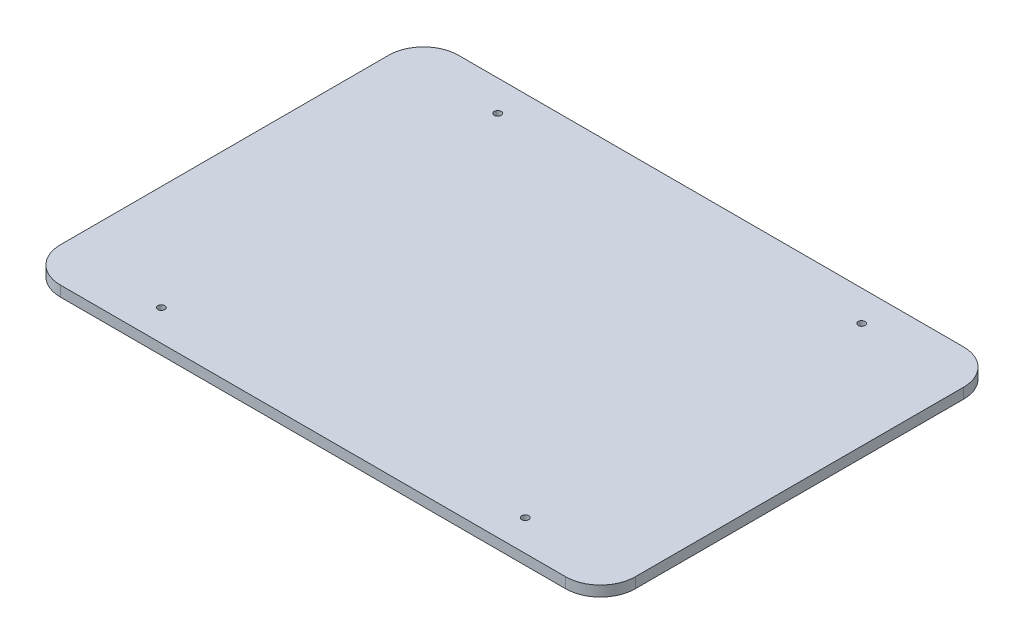
ISO-10303-21;
HEADER;
FILE_DESCRIPTION(('STEP AP214'),'2;1');
FILE_NAME('part.step','',(''),(''),'','','');
FILE_SCHEMA(('AUTOMOTIVE_DESIGN { 1 0 10303 214 1 1 1 1 }'));
ENDSEC;
DATA;
#1=APPLICATION_CONTEXT('core data for automotive mechanical design processes');
#2=APPLICATION_PROTOCOL_DEFINITION('international standard','automotive_design',2000,#1);
#3=PRODUCT_CONTEXT('',#1,'mechanical');
#4=PRODUCT('Part','Part','',(#3));
#5=PRODUCT_RELATED_PRODUCT_CATEGORY('part','',(#4));
#6=PRODUCT_DEFINITION_FORMATION('','',#4);
#7=PRODUCT_DEFINITION_CONTEXT('part definition',#1,'design');
#8=PRODUCT_DEFINITION('design','',#6,#7);
#9=PRODUCT_DEFINITION_SHAPE('','',#8);
#10=(LENGTH_UNIT() NAMED_UNIT(*) SI_UNIT(.MILLI.,.METRE.));
#11=(NAMED_UNIT(*) PLANE_ANGLE_UNIT() SI_UNIT($,.RADIAN.));
#12=(NAMED_UNIT(*) SI_UNIT($,.STERADIAN.) SOLID_ANGLE_UNIT());
#13=UNCERTAINTY_MEASURE_WITH_UNIT(LENGTH_MEASURE(1.E-05),#10,'distance_accuracy_value','');
#14=(GEOMETRIC_REPRESENTATION_CONTEXT(3) GLOBAL_UNCERTAINTY_ASSIGNED_CONTEXT((#13)) GLOBAL_UNIT_ASSIGNED_CONTEXT((#10,
#11,#12)) REPRESENTATION_CONTEXT('',''));
#15=CARTESIAN_POINT('',(0.,0.,0.));
#16=DIRECTION('',(0.,0.,1.));
#17=DIRECTION('',(1.,0.,0.));
#18=AXIS2_PLACEMENT_3D('',#15,#16,#17);
#19=CARTESIAN_POINT('',(82.55,3.,-57.15));
#20=DIRECTION('',(-1.,0.,0.));
#21=DIRECTION('',(0.,0.,1.));
#22=AXIS2_PLACEMENT_3D('',#19,#20,#21);
#23=PLANE('',#22);
#24=DIRECTION('',(0.,0.,-1.));
#25=VECTOR('',#24,1.);
#26=CARTESIAN_POINT('',(82.55,3.,-57.15));
#27=LINE('',#26,#25);
#28=CARTESIAN_POINT('',(82.55,3.,47.15));
#29=VERTEX_POINT('',#28);
#30=CARTESIAN_POINT('',(82.55,3.,-47.15));
#31=VERTEX_POINT('',#30);
#32=EDGE_CURVE('E118',#29,#31,#27,.T.);
#33=ORIENTED_EDGE('',*,*,#32,.F.);
#34=DIRECTION('',(0.,-1.,0.));
#35=VECTOR('',#34,1.);
#36=CARTESIAN_POINT('',(82.55,3.,47.15));
#37=LINE('',#36,#35);
#38=CARTESIAN_POINT('',(82.55,0.,47.15));
#39=VERTEX_POINT('',#38);
#40=EDGE_CURVE('E103',#29,#39,#37,.T.);
#41=ORIENTED_EDGE('',*,*,#40,.T.);
#42=DIRECTION('',(0.,0.,-1.));
#43=VECTOR('',#42,1.);
#44=CARTESIAN_POINT('',(82.55,0.,-57.15));
#45=LINE('',#44,#43);
#46=CARTESIAN_POINT('',(82.55,0.,-47.15));
#47=VERTEX_POINT('',#46);
#48=EDGE_CURVE('E115',#39,#47,#45,.T.);
#49=ORIENTED_EDGE('',*,*,#48,.T.);
#50=DIRECTION('',(0.,-1.,0.));
#51=VECTOR('',#50,1.);
#52=CARTESIAN_POINT('',(82.55,3.,-47.15));
#53=LINE('',#52,#51);
#54=EDGE_CURVE('E120',#47,#31,#53,.F.);
#55=ORIENTED_EDGE('',*,*,#54,.T.);
#56=EDGE_LOOP('',(#33,#41,#49,#55));
#57=FACE_BOUND('',#56,.T.);
#58=ADVANCED_FACE('F33',(#57),#23,.F.);
#59=CARTESIAN_POINT('',(-82.55,3.,-57.15));
#60=DIRECTION('',(0.,0.,1.));
#61=DIRECTION('',(1.,0.,0.));
#62=AXIS2_PLACEMENT_3D('',#59,#60,#61);
#63=PLANE('',#62);
#64=DIRECTION('',(-1.,0.,0.));
#65=VECTOR('',#64,1.);
#66=CARTESIAN_POINT('',(-82.55,3.,-57.15));
#67=LINE('',#66,#65);
#68=CARTESIAN_POINT('',(72.55,3.,-57.15));
#69=VERTEX_POINT('',#68);
#70=CARTESIAN_POINT('',(-72.55,3.,-57.15));
#71=VERTEX_POINT('',#70);
#72=EDGE_CURVE('E164',#69,#71,#67,.T.);
#73=ORIENTED_EDGE('',*,*,#72,.F.);
#74=DIRECTION('',(0.,-1.,0.));
#75=VECTOR('',#74,1.);
#76=CARTESIAN_POINT('',(72.55,3.,-57.15));
#77=LINE('',#76,#75);
#78=CARTESIAN_POINT('',(72.55,0.,-57.15));
#79=VERTEX_POINT('',#78);
#80=EDGE_CURVE('E157',#69,#79,#77,.T.);
#81=ORIENTED_EDGE('',*,*,#80,.T.);
#82=DIRECTION('',(-1.,0.,0.));
#83=VECTOR('',#82,1.);
#84=CARTESIAN_POINT('',(-82.55,0.,-57.15));
#85=LINE('',#84,#83);
#86=CARTESIAN_POINT('',(-72.55,0.,-57.15));
#87=VERTEX_POINT('',#86);
#88=EDGE_CURVE('E124',#79,#87,#85,.T.);
#89=ORIENTED_EDGE('',*,*,#88,.T.);
#90=DIRECTION('',(0.,-1.,0.));
#91=VECTOR('',#90,1.);
#92=CARTESIAN_POINT('',(-72.55,3.,-57.15));
#93=LINE('',#92,#91);
#94=EDGE_CURVE('E155',#87,#71,#93,.F.);
#95=ORIENTED_EDGE('',*,*,#94,.T.);
#96=EDGE_LOOP('',(#73,#81,#89,#95));
#97=FACE_BOUND('',#96,.T.);
#98=ADVANCED_FACE('F162',(#97),#63,.F.);
#99=CARTESIAN_POINT('',(-82.55,3.,-57.15));
#100=DIRECTION('',(1.,0.,0.));
#101=DIRECTION('',(0.,0.,-1.));
#102=AXIS2_PLACEMENT_3D('',#99,#100,#101);
#103=PLANE('',#102);
#104=DIRECTION('',(0.,0.,1.));
#105=VECTOR('',#104,1.);
#106=CARTESIAN_POINT('',(-82.55,3.,-57.15));
#107=LINE('',#106,#105);
#108=CARTESIAN_POINT('',(-82.55,3.,-47.15));
#109=VERTEX_POINT('',#108);
#110=CARTESIAN_POINT('',(-82.55,3.,47.15));
#111=VERTEX_POINT('',#110);
#112=EDGE_CURVE('E172',#109,#111,#107,.T.);
#113=ORIENTED_EDGE('',*,*,#112,.F.);
#114=DIRECTION('',(0.,-1.,0.));
#115=VECTOR('',#114,1.);
#116=CARTESIAN_POINT('',(-82.55,3.,-47.15));
#117=LINE('',#116,#115);
#118=CARTESIAN_POINT('',(-82.55,0.,-47.15));
#119=VERTEX_POINT('',#118);
#120=EDGE_CURVE('E11',#109,#119,#117,.T.);
#121=ORIENTED_EDGE('',*,*,#120,.T.);
#122=DIRECTION('',(0.,0.,1.));
#123=VECTOR('',#122,1.);
#124=CARTESIAN_POINT('',(-82.55,0.,-57.15));
#125=LINE('',#124,#123);
#126=CARTESIAN_POINT('',(-82.55,0.,47.15));
#127=VERTEX_POINT('',#126);
#128=EDGE_CURVE('E128',#119,#127,#125,.T.);
#129=ORIENTED_EDGE('',*,*,#128,.T.);
#130=DIRECTION('',(0.,-1.,0.));
#131=VECTOR('',#130,1.);
#132=CARTESIAN_POINT('',(-82.55,3.,47.15));
#133=LINE('',#132,#131);
#134=EDGE_CURVE('E41',#127,#111,#133,.F.);
#135=ORIENTED_EDGE('',*,*,#134,.T.);
#136=EDGE_LOOP('',(#113,#121,#129,#135));
#137=FACE_BOUND('',#136,.T.);
#138=ADVANCED_FACE('F171',(#137),#103,.F.);
#139=CARTESIAN_POINT('',(-82.55,3.,57.15));
#140=DIRECTION('',(0.,0.,-1.));
#141=DIRECTION('',(-1.,0.,0.));
#142=AXIS2_PLACEMENT_3D('',#139,#140,#141);
#143=PLANE('',#142);
#144=DIRECTION('',(1.,0.,0.));
#145=VECTOR('',#144,1.);
#146=CARTESIAN_POINT('',(-82.55,0.,57.15));
#147=LINE('',#146,#145);
#148=CARTESIAN_POINT('',(-72.55,0.,57.15));
#149=VERTEX_POINT('',#148);
#150=CARTESIAN_POINT('',(72.55,0.,57.15));
#151=VERTEX_POINT('',#150);
#152=EDGE_CURVE('E138',#149,#151,#147,.T.);
#153=ORIENTED_EDGE('',*,*,#152,.T.);
#154=DIRECTION('',(0.,-1.,0.));
#155=VECTOR('',#154,1.);
#156=CARTESIAN_POINT('',(72.55,3.,57.15));
#157=LINE('',#156,#155);
#158=CARTESIAN_POINT('',(72.55,3.,57.15));
#159=VERTEX_POINT('',#158);
#160=EDGE_CURVE('E104',#151,#159,#157,.F.);
#161=ORIENTED_EDGE('',*,*,#160,.T.);
#162=DIRECTION('',(1.,0.,0.));
#163=VECTOR('',#162,1.);
#164=CARTESIAN_POINT('',(-82.55,3.,57.15));
#165=LINE('',#164,#163);
#166=CARTESIAN_POINT('',(-72.55,3.,57.15));
#167=VERTEX_POINT('',#166);
#168=EDGE_CURVE('E134',#167,#159,#165,.T.);
#169=ORIENTED_EDGE('',*,*,#168,.F.);
#170=DIRECTION('',(0.,-1.,0.));
#171=VECTOR('',#170,1.);
#172=CARTESIAN_POINT('',(-72.55,3.,57.15));
#173=LINE('',#172,#171);
#174=EDGE_CURVE('E109',#167,#149,#173,.T.);
#175=ORIENTED_EDGE('',*,*,#174,.T.);
#176=EDGE_LOOP('',(#153,#161,#169,#175));
#177=FACE_BOUND('',#176,.T.);
#178=ADVANCED_FACE('F257',(#177),#143,.F.);
#179=CARTESIAN_POINT('',(0.,3.,0.));
#180=DIRECTION('',(0.,1.,0.));
#181=DIRECTION('',(0.,0.,1.));
#182=AXIS2_PLACEMENT_3D('',#179,#180,#181);
#183=PLANE('',#182);
#184=CARTESIAN_POINT('',(-52.4300000000003,3.,-48.3399999999993));
#185=DIRECTION('',(0.,-1.,0.));
#186=DIRECTION('',(0.,0.,-1.));
#187=AXIS2_PLACEMENT_3D('',#184,#185,#186);
#188=CIRCLE('',#187,0.999999999999998);
#189=CARTESIAN_POINT('',(-52.4300000000003,3.,-49.3399999999993));
#190=VERTEX_POINT('',#189);
#191=EDGE_CURVE('E179',#190,#190,#188,.T.);
#192=ORIENTED_EDGE('',*,*,#191,.T.);
#193=EDGE_LOOP('',(#192));
#194=FACE_BOUND('',#193,.T.);
#195=CARTESIAN_POINT('',(52.07,3.,48.26));
#196=DIRECTION('',(0.,-1.,0.));
#197=DIRECTION('',(0.,0.,-1.));
#198=AXIS2_PLACEMENT_3D('',#195,#196,#197);
#199=CIRCLE('',#198,0.999999999999998);
#200=CARTESIAN_POINT('',(52.07,3.,47.26));
#201=VERTEX_POINT('',#200);
#202=EDGE_CURVE('E184',#201,#201,#199,.T.);
#203=ORIENTED_EDGE('',*,*,#202,.T.);
#204=EDGE_LOOP('',(#203));
#205=FACE_BOUND('',#204,.T.);
#206=CARTESIAN_POINT('',(52.0699999999997,3.,-48.34));
#207=DIRECTION('',(0.,-1.,0.));
#208=DIRECTION('',(0.,0.,-1.));
#209=AXIS2_PLACEMENT_3D('',#206,#207,#208);
#210=CIRCLE('',#209,0.999999999999998);
#211=CARTESIAN_POINT('',(52.0699999999997,3.,-49.34));
#212=VERTEX_POINT('',#211);
#213=EDGE_CURVE('E185',#212,#212,#210,.T.);
#214=ORIENTED_EDGE('',*,*,#213,.T.);
#215=EDGE_LOOP('',(#214));
#216=FACE_BOUND('',#215,.T.);
#217=CARTESIAN_POINT('',(-52.43,3.,48.2600000000007));
#218=DIRECTION('',(0.,-1.,0.));
#219=DIRECTION('',(0.,0.,-1.));
#220=AXIS2_PLACEMENT_3D('',#217,#218,#219);
#221=CIRCLE('',#220,0.999999999999998);
#222=CARTESIAN_POINT('',(-52.43,3.,47.2600000000007));
#223=VERTEX_POINT('',#222);
#224=EDGE_CURVE('E125',#223,#223,#221,.T.);
#225=ORIENTED_EDGE('',*,*,#224,.T.);
#226=EDGE_LOOP('',(#225));
#227=FACE_BOUND('',#226,.T.);
#228=ORIENTED_EDGE('',*,*,#168,.T.);
#229=CARTESIAN_POINT('',(72.55,3.,47.15));
#230=DIRECTION('',(0.,1.,0.));
#231=DIRECTION('',(0.,0.,1.));
#232=AXIS2_PLACEMENT_3D('',#229,#230,#231);
#233=CIRCLE('',#232,10.);
#234=EDGE_CURVE('E153',#159,#29,#233,.T.);
#235=ORIENTED_EDGE('',*,*,#234,.T.);
#236=ORIENTED_EDGE('',*,*,#32,.T.);
#237=CARTESIAN_POINT('',(72.55,3.,-47.15));
#238=DIRECTION('',(0.,1.,0.));
#239=DIRECTION('',(0.,0.,1.));
#240=AXIS2_PLACEMENT_3D('',#237,#238,#239);
#241=CIRCLE('',#240,10.);
#242=EDGE_CURVE('E151',#31,#69,#241,.T.);
#243=ORIENTED_EDGE('',*,*,#242,.T.);
#244=ORIENTED_EDGE('',*,*,#72,.T.);
#245=CARTESIAN_POINT('',(-72.55,3.,-47.15));
#246=DIRECTION('',(0.,1.,0.));
#247=DIRECTION('',(0.,0.,1.));
#248=AXIS2_PLACEMENT_3D('',#245,#246,#247);
#249=CIRCLE('',#248,10.);
#250=EDGE_CURVE('E54',#71,#109,#249,.T.);
#251=ORIENTED_EDGE('',*,*,#250,.T.);
#252=ORIENTED_EDGE('',*,*,#112,.T.);
#253=CARTESIAN_POINT('',(-72.55,3.,47.15));
#254=DIRECTION('',(0.,1.,0.));
#255=DIRECTION('',(0.,0.,1.));
#256=AXIS2_PLACEMENT_3D('',#253,#254,#255);
#257=CIRCLE('',#256,10.);
#258=EDGE_CURVE('E148',#111,#167,#257,.T.);
#259=ORIENTED_EDGE('',*,*,#258,.T.);
#260=EDGE_LOOP('',(#228,#235,#236,#243,#244,#251,#252,#259));
#261=FACE_BOUND('',#260,.T.);
#262=ADVANCED_FACE('F199',(#194,#205,#216,#227,#261),#183,.T.);
#263=CARTESIAN_POINT('',(0.,0.,0.));
#264=DIRECTION('',(0.,1.,0.));
#265=DIRECTION('',(0.,0.,1.));
#266=AXIS2_PLACEMENT_3D('',#263,#264,#265);
#267=PLANE('',#266);
#268=CARTESIAN_POINT('',(-52.4300000000003,0.,-48.3399999999993));
#269=DIRECTION('',(0.,-1.,0.));
#270=DIRECTION('',(0.,0.,-1.));
#271=AXIS2_PLACEMENT_3D('',#268,#269,#270);
#272=CIRCLE('',#271,0.999999999999998);
#273=CARTESIAN_POINT('',(-52.4300000000003,0.,-49.3399999999993));
#274=VERTEX_POINT('',#273);
#275=EDGE_CURVE('E188',#274,#274,#272,.T.);
#276=ORIENTED_EDGE('',*,*,#275,.F.);
#277=EDGE_LOOP('',(#276));
#278=FACE_BOUND('',#277,.T.);
#279=CARTESIAN_POINT('',(52.07,0.,48.26));
#280=DIRECTION('',(0.,-1.,0.));
#281=DIRECTION('',(0.,0.,-1.));
#282=AXIS2_PLACEMENT_3D('',#279,#280,#281);
#283=CIRCLE('',#282,0.999999999999998);
#284=CARTESIAN_POINT('',(52.07,0.,47.26));
#285=VERTEX_POINT('',#284);
#286=EDGE_CURVE('E181',#285,#285,#283,.T.);
#287=ORIENTED_EDGE('',*,*,#286,.F.);
#288=EDGE_LOOP('',(#287));
#289=FACE_BOUND('',#288,.T.);
#290=CARTESIAN_POINT('',(52.0699999999997,0.,-48.34));
#291=DIRECTION('',(0.,-1.,0.));
#292=DIRECTION('',(0.,0.,-1.));
#293=AXIS2_PLACEMENT_3D('',#290,#291,#292);
#294=CIRCLE('',#293,0.999999999999998);
#295=CARTESIAN_POINT('',(52.0699999999997,0.,-49.34));
#296=VERTEX_POINT('',#295);
#297=EDGE_CURVE('E193',#296,#296,#294,.T.);
#298=ORIENTED_EDGE('',*,*,#297,.F.);
#299=EDGE_LOOP('',(#298));
#300=FACE_BOUND('',#299,.T.);
#301=CARTESIAN_POINT('',(-52.43,0.,48.2600000000007));
#302=DIRECTION('',(0.,-1.,0.));
#303=DIRECTION('',(0.,0.,-1.));
#304=AXIS2_PLACEMENT_3D('',#301,#302,#303);
#305=CIRCLE('',#304,0.999999999999998);
#306=CARTESIAN_POINT('',(-52.43,0.,47.2600000000007));
#307=VERTEX_POINT('',#306);
#308=EDGE_CURVE('E131',#307,#307,#305,.T.);
#309=ORIENTED_EDGE('',*,*,#308,.F.);
#310=EDGE_LOOP('',(#309));
#311=FACE_BOUND('',#310,.T.);
#312=ORIENTED_EDGE('',*,*,#48,.F.);
#313=CARTESIAN_POINT('',(72.55,0.,47.15));
#314=DIRECTION('',(0.,1.,0.));
#315=DIRECTION('',(0.,0.,1.));
#316=AXIS2_PLACEMENT_3D('',#313,#314,#315);
#317=CIRCLE('',#316,10.);
#318=EDGE_CURVE('E99',#39,#151,#317,.F.);
#319=ORIENTED_EDGE('',*,*,#318,.T.);
#320=ORIENTED_EDGE('',*,*,#152,.F.);
#321=CARTESIAN_POINT('',(-72.55,0.,47.15));
#322=DIRECTION('',(0.,1.,0.));
#323=DIRECTION('',(0.,0.,1.));
#324=AXIS2_PLACEMENT_3D('',#321,#322,#323);
#325=CIRCLE('',#324,10.);
#326=EDGE_CURVE('E119',#149,#127,#325,.F.);
#327=ORIENTED_EDGE('',*,*,#326,.T.);
#328=ORIENTED_EDGE('',*,*,#128,.F.);
#329=CARTESIAN_POINT('',(-72.55,0.,-47.15));
#330=DIRECTION('',(0.,1.,0.));
#331=DIRECTION('',(0.,0.,1.));
#332=AXIS2_PLACEMENT_3D('',#329,#330,#331);
#333=CIRCLE('',#332,10.);
#334=EDGE_CURVE('E142',#119,#87,#333,.F.);
#335=ORIENTED_EDGE('',*,*,#334,.T.);
#336=ORIENTED_EDGE('',*,*,#88,.F.);
#337=CARTESIAN_POINT('',(72.55,0.,-47.15));
#338=DIRECTION('',(0.,1.,0.));
#339=DIRECTION('',(0.,0.,1.));
#340=AXIS2_PLACEMENT_3D('',#337,#338,#339);
#341=CIRCLE('',#340,10.);
#342=EDGE_CURVE('E110',#79,#47,#341,.F.);
#343=ORIENTED_EDGE('',*,*,#342,.T.);
#344=EDGE_LOOP('',(#312,#319,#320,#327,#328,#335,#336,#343));
#345=FACE_BOUND('',#344,.T.);
#346=ADVANCED_FACE('F122',(#278,#289,#300,#311,#345),#267,.F.);
#347=CARTESIAN_POINT('',(72.55,3.,47.15));
#348=DIRECTION('',(0.,-1.,0.));
#349=DIRECTION('',(0.,0.,-1.));
#350=AXIS2_PLACEMENT_3D('',#347,#348,#349);
#351=CYLINDRICAL_SURFACE('',#350,10.);
#352=ORIENTED_EDGE('',*,*,#234,.F.);
#353=ORIENTED_EDGE('',*,*,#160,.F.);
#354=ORIENTED_EDGE('',*,*,#318,.F.);
#355=ORIENTED_EDGE('',*,*,#40,.F.);
#356=EDGE_LOOP('',(#352,#353,#354,#355));
#357=FACE_BOUND('',#356,.T.);
#358=ADVANCED_FACE('F102',(#357),#351,.T.);
#359=CARTESIAN_POINT('',(72.55,3.,-47.15));
#360=DIRECTION('',(0.,-1.,0.));
#361=DIRECTION('',(0.,0.,-1.));
#362=AXIS2_PLACEMENT_3D('',#359,#360,#361);
#363=CYLINDRICAL_SURFACE('',#362,10.);
#364=ORIENTED_EDGE('',*,*,#242,.F.);
#365=ORIENTED_EDGE('',*,*,#54,.F.);
#366=ORIENTED_EDGE('',*,*,#342,.F.);
#367=ORIENTED_EDGE('',*,*,#80,.F.);
#368=EDGE_LOOP('',(#364,#365,#366,#367));
#369=FACE_BOUND('',#368,.T.);
#370=ADVANCED_FACE('F236',(#369),#363,.T.);
#371=CARTESIAN_POINT('',(-72.55,3.,-47.15));
#372=DIRECTION('',(0.,-1.,0.));
#373=DIRECTION('',(0.,0.,-1.));
#374=AXIS2_PLACEMENT_3D('',#371,#372,#373);
#375=CYLINDRICAL_SURFACE('',#374,10.);
#376=ORIENTED_EDGE('',*,*,#250,.F.);
#377=ORIENTED_EDGE('',*,*,#94,.F.);
#378=ORIENTED_EDGE('',*,*,#334,.F.);
#379=ORIENTED_EDGE('',*,*,#120,.F.);
#380=EDGE_LOOP('',(#376,#377,#378,#379));
#381=FACE_BOUND('',#380,.T.);
#382=ADVANCED_FACE('F170',(#381),#375,.T.);
#383=CARTESIAN_POINT('',(-72.55,3.,47.15));
#384=DIRECTION('',(0.,-1.,0.));
#385=DIRECTION('',(0.,0.,-1.));
#386=AXIS2_PLACEMENT_3D('',#383,#384,#385);
#387=CYLINDRICAL_SURFACE('',#386,10.);
#388=ORIENTED_EDGE('',*,*,#258,.F.);
#389=ORIENTED_EDGE('',*,*,#134,.F.);
#390=ORIENTED_EDGE('',*,*,#326,.F.);
#391=ORIENTED_EDGE('',*,*,#174,.F.);
#392=EDGE_LOOP('',(#388,#389,#390,#391));
#393=FACE_BOUND('',#392,.T.);
#394=ADVANCED_FACE('F35',(#393),#387,.T.);
#395=CARTESIAN_POINT('',(-52.43,3.,48.2600000000007));
#396=DIRECTION('',(0.,-1.,0.));
#397=DIRECTION('',(0.,0.,-1.));
#398=AXIS2_PLACEMENT_3D('',#395,#396,#397);
#399=CYLINDRICAL_SURFACE('',#398,0.999999999999998);
#400=ORIENTED_EDGE('',*,*,#224,.F.);
#401=EDGE_LOOP('',(#400));
#402=FACE_BOUND('',#401,.T.);
#403=ORIENTED_EDGE('',*,*,#308,.T.);
#404=EDGE_LOOP('',(#403));
#405=FACE_BOUND('',#404,.T.);
#406=ADVANCED_FACE('F206',(#402,#405),#399,.F.);
#407=CARTESIAN_POINT('',(52.0699999999997,3.,-48.34));
#408=DIRECTION('',(0.,-1.,0.));
#409=DIRECTION('',(0.,0.,-1.));
#410=AXIS2_PLACEMENT_3D('',#407,#408,#409);
#411=CYLINDRICAL_SURFACE('',#410,0.999999999999998);
#412=ORIENTED_EDGE('',*,*,#213,.F.);
#413=EDGE_LOOP('',(#412));
#414=FACE_BOUND('',#413,.T.);
#415=ORIENTED_EDGE('',*,*,#297,.T.);
#416=EDGE_LOOP('',(#415));
#417=FACE_BOUND('',#416,.T.);
#418=ADVANCED_FACE('F202',(#414,#417),#411,.F.);
#419=CARTESIAN_POINT('',(52.07,3.,48.26));
#420=DIRECTION('',(0.,-1.,0.));
#421=DIRECTION('',(0.,0.,-1.));
#422=AXIS2_PLACEMENT_3D('',#419,#420,#421);
#423=CYLINDRICAL_SURFACE('',#422,0.999999999999998);
#424=ORIENTED_EDGE('',*,*,#202,.F.);
#425=EDGE_LOOP('',(#424));
#426=FACE_BOUND('',#425,.T.);
#427=ORIENTED_EDGE('',*,*,#286,.T.);
#428=EDGE_LOOP('',(#427));
#429=FACE_BOUND('',#428,.T.);
#430=ADVANCED_FACE('F205',(#426,#429),#423,.F.);
#431=CARTESIAN_POINT('',(-52.4300000000003,3.,-48.3399999999993));
#432=DIRECTION('',(0.,-1.,0.));
#433=DIRECTION('',(0.,0.,-1.));
#434=AXIS2_PLACEMENT_3D('',#431,#432,#433);
#435=CYLINDRICAL_SURFACE('',#434,0.999999999999998);
#436=ORIENTED_EDGE('',*,*,#191,.F.);
#437=EDGE_LOOP('',(#436));
#438=FACE_BOUND('',#437,.T.);
#439=ORIENTED_EDGE('',*,*,#275,.T.);
#440=EDGE_LOOP('',(#439));
#441=FACE_BOUND('',#440,.T.);
#442=ADVANCED_FACE('F285',(#438,#441),#435,.F.);
#443=CLOSED_SHELL('',(#58,#98,#138,#178,#262,#346,#358,#370,#382,#394,#406,#418,#430,#442));
#444=MANIFOLD_SOLID_BREP('B2',#443);
#445=ADVANCED_BREP_SHAPE_REPRESENTATION('',(#18,#444),#14);
#446=SHAPE_DEFINITION_REPRESENTATION(#9,#445);
ENDSEC;
END-ISO-10303-21;
